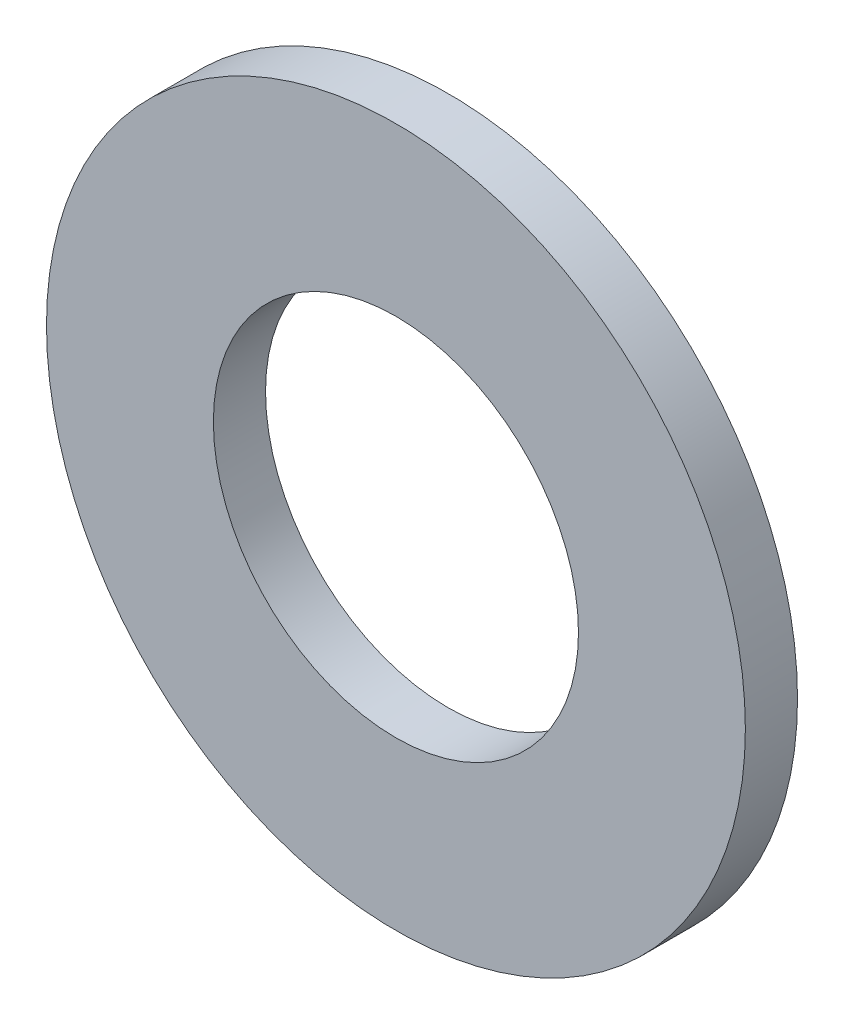
ISO-10303-21;
HEADER;
FILE_DESCRIPTION(('STEP AP214'),'2;1');
FILE_NAME('part.step','',(''),(''),'','','');
FILE_SCHEMA(('AUTOMOTIVE_DESIGN { 1 0 10303 214 1 1 1 1 }'));
ENDSEC;
DATA;
#1=APPLICATION_CONTEXT('core data for automotive mechanical design processes');
#2=APPLICATION_PROTOCOL_DEFINITION('international standard','automotive_design',2000,#1);
#3=PRODUCT_CONTEXT('',#1,'mechanical');
#4=PRODUCT('Part','Part','',(#3));
#5=PRODUCT_RELATED_PRODUCT_CATEGORY('part','',(#4));
#6=PRODUCT_DEFINITION_FORMATION('','',#4);
#7=PRODUCT_DEFINITION_CONTEXT('part definition',#1,'design');
#8=PRODUCT_DEFINITION('design','',#6,#7);
#9=PRODUCT_DEFINITION_SHAPE('','',#8);
#10=(LENGTH_UNIT() NAMED_UNIT(*) SI_UNIT(.MILLI.,.METRE.));
#11=(NAMED_UNIT(*) PLANE_ANGLE_UNIT() SI_UNIT($,.RADIAN.));
#12=(NAMED_UNIT(*) SI_UNIT($,.STERADIAN.) SOLID_ANGLE_UNIT());
#13=UNCERTAINTY_MEASURE_WITH_UNIT(LENGTH_MEASURE(1.E-05),#10,'distance_accuracy_value','');
#14=(GEOMETRIC_REPRESENTATION_CONTEXT(3) GLOBAL_UNCERTAINTY_ASSIGNED_CONTEXT((#13)) GLOBAL_UNIT_ASSIGNED_CONTEXT((#10,
#11,#12)) REPRESENTATION_CONTEXT('',''));
#15=CARTESIAN_POINT('',(0.,0.,0.));
#16=DIRECTION('',(0.,0.,1.));
#17=DIRECTION('',(1.,0.,0.));
#18=AXIS2_PLACEMENT_3D('',#15,#16,#17);
#19=CARTESIAN_POINT('',(0.,0.,0.));
#20=DIRECTION('',(0.,0.,1.));
#21=DIRECTION('',(1.,0.,0.));
#22=AXIS2_PLACEMENT_3D('',#19,#20,#21);
#23=PLANE('',#22);
#24=CARTESIAN_POINT('',(0.,0.,0.));
#25=DIRECTION('',(0.,0.,1.));
#26=DIRECTION('',(1.,0.,0.));
#27=AXIS2_PLACEMENT_3D('',#24,#25,#26);
#28=CIRCLE('',#27,1.75);
#29=CARTESIAN_POINT('',(1.75,0.,0.));
#30=VERTEX_POINT('',#29);
#31=EDGE_CURVE('E29',#30,#30,#28,.T.);
#32=ORIENTED_EDGE('',*,*,#31,.T.);
#33=EDGE_LOOP('',(#32));
#34=FACE_BOUND('',#33,.T.);
#35=CARTESIAN_POINT('',(0.,0.,0.));
#36=DIRECTION('',(0.,0.,1.));
#37=DIRECTION('',(1.,0.,0.));
#38=AXIS2_PLACEMENT_3D('',#35,#36,#37);
#39=CIRCLE('',#38,3.35);
#40=CARTESIAN_POINT('',(3.35,0.,0.));
#41=VERTEX_POINT('',#40);
#42=EDGE_CURVE('E20',#41,#41,#39,.T.);
#43=ORIENTED_EDGE('',*,*,#42,.F.);
#44=EDGE_LOOP('',(#43));
#45=FACE_BOUND('',#44,.T.);
#46=ADVANCED_FACE('F17',(#34,#45),#23,.F.);
#47=CARTESIAN_POINT('',(0.,0.,0.));
#48=DIRECTION('',(0.,0.,1.));
#49=DIRECTION('',(1.,0.,0.));
#50=AXIS2_PLACEMENT_3D('',#47,#48,#49);
#51=CYLINDRICAL_SURFACE('',#50,3.35);
#52=ORIENTED_EDGE('',*,*,#42,.T.);
#53=EDGE_LOOP('',(#52));
#54=FACE_BOUND('',#53,.T.);
#55=CARTESIAN_POINT('',(0.,0.,0.5));
#56=DIRECTION('',(0.,0.,1.));
#57=DIRECTION('',(1.,0.,0.));
#58=AXIS2_PLACEMENT_3D('',#55,#56,#57);
#59=CIRCLE('',#58,3.35);
#60=CARTESIAN_POINT('',(3.35,0.,0.5));
#61=VERTEX_POINT('',#60);
#62=EDGE_CURVE('E24',#61,#61,#59,.T.);
#63=ORIENTED_EDGE('',*,*,#62,.F.);
#64=EDGE_LOOP('',(#63));
#65=FACE_BOUND('',#64,.T.);
#66=ADVANCED_FACE('F37',(#54,#65),#51,.T.);
#67=CARTESIAN_POINT('',(0.,0.,0.));
#68=DIRECTION('',(0.,0.,1.));
#69=DIRECTION('',(1.,0.,0.));
#70=AXIS2_PLACEMENT_3D('',#67,#68,#69);
#71=CYLINDRICAL_SURFACE('',#70,1.75);
#72=ORIENTED_EDGE('',*,*,#31,.F.);
#73=EDGE_LOOP('',(#72));
#74=FACE_BOUND('',#73,.T.);
#75=CARTESIAN_POINT('',(0.,0.,0.5));
#76=DIRECTION('',(0.,0.,1.));
#77=DIRECTION('',(1.,0.,0.));
#78=AXIS2_PLACEMENT_3D('',#75,#76,#77);
#79=CIRCLE('',#78,1.75);
#80=CARTESIAN_POINT('',(1.75,0.,0.5));
#81=VERTEX_POINT('',#80);
#82=EDGE_CURVE('E10',#81,#81,#79,.F.);
#83=ORIENTED_EDGE('',*,*,#82,.F.);
#84=EDGE_LOOP('',(#83));
#85=FACE_BOUND('',#84,.T.);
#86=ADVANCED_FACE('F45',(#74,#85),#71,.F.);
#87=CARTESIAN_POINT('',(0.,0.,0.5));
#88=DIRECTION('',(0.,0.,1.));
#89=DIRECTION('',(1.,0.,0.));
#90=AXIS2_PLACEMENT_3D('',#87,#88,#89);
#91=PLANE('',#90);
#92=ORIENTED_EDGE('',*,*,#82,.T.);
#93=EDGE_LOOP('',(#92));
#94=FACE_BOUND('',#93,.T.);
#95=ORIENTED_EDGE('',*,*,#62,.T.);
#96=EDGE_LOOP('',(#95));
#97=FACE_BOUND('',#96,.T.);
#98=ADVANCED_FACE('F46',(#94,#97),#91,.T.);
#99=CLOSED_SHELL('',(#46,#66,#86,#98));
#100=MANIFOLD_SOLID_BREP('B1',#99);
#101=ADVANCED_BREP_SHAPE_REPRESENTATION('',(#18,#100),#14);
#102=SHAPE_DEFINITION_REPRESENTATION(#9,#101);
ENDSEC;
END-ISO-10303-21;
